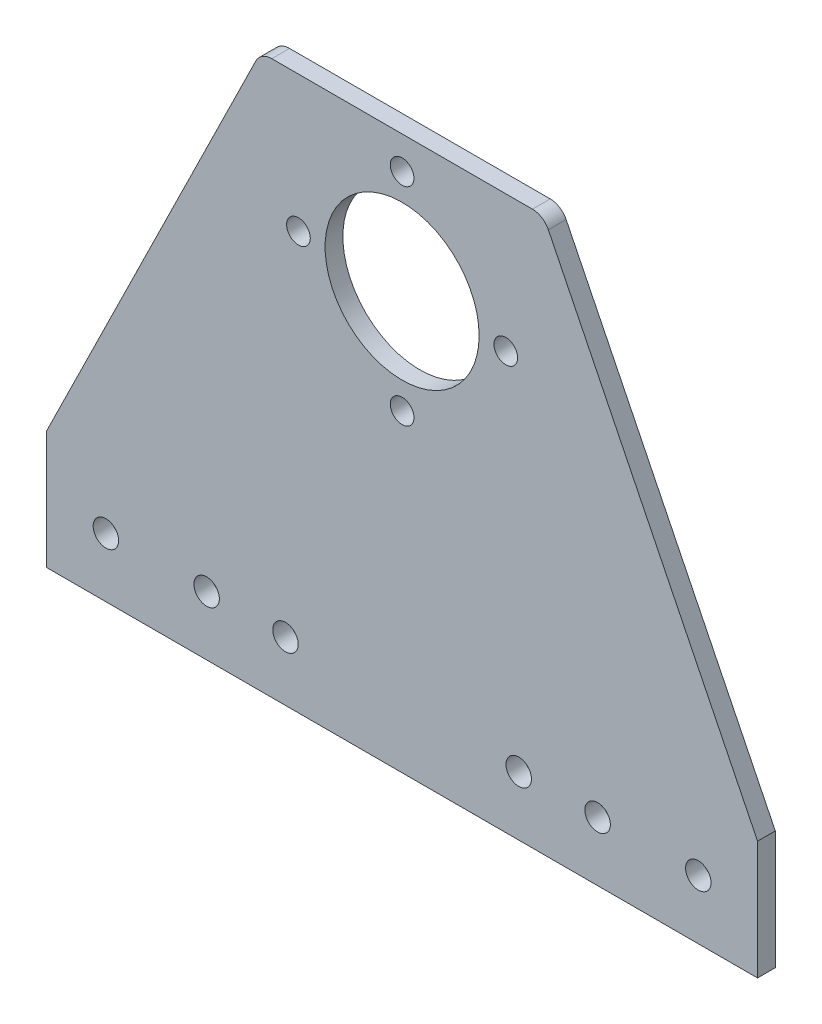
ISO-10303-21;
HEADER;
FILE_DESCRIPTION(('STEP AP214'),'2;1');
FILE_NAME('part.step','',(''),(''),'','','');
FILE_SCHEMA(('AUTOMOTIVE_DESIGN { 1 0 10303 214 1 1 1 1 }'));
ENDSEC;
DATA;
#1=APPLICATION_CONTEXT('core data for automotive mechanical design processes');
#2=APPLICATION_PROTOCOL_DEFINITION('international standard','automotive_design',2000,#1);
#3=PRODUCT_CONTEXT('',#1,'mechanical');
#4=PRODUCT('Part','Part','',(#3));
#5=PRODUCT_RELATED_PRODUCT_CATEGORY('part','',(#4));
#6=PRODUCT_DEFINITION_FORMATION('','',#4);
#7=PRODUCT_DEFINITION_CONTEXT('part definition',#1,'design');
#8=PRODUCT_DEFINITION('design','',#6,#7);
#9=PRODUCT_DEFINITION_SHAPE('','',#8);
#10=(LENGTH_UNIT() NAMED_UNIT(*) SI_UNIT(.MILLI.,.METRE.));
#11=(NAMED_UNIT(*) PLANE_ANGLE_UNIT() SI_UNIT($,.RADIAN.));
#12=(NAMED_UNIT(*) SI_UNIT($,.STERADIAN.) SOLID_ANGLE_UNIT());
#13=UNCERTAINTY_MEASURE_WITH_UNIT(LENGTH_MEASURE(1.E-05),#10,'distance_accuracy_value','');
#14=(GEOMETRIC_REPRESENTATION_CONTEXT(3) GLOBAL_UNCERTAINTY_ASSIGNED_CONTEXT((#13)) GLOBAL_UNIT_ASSIGNED_CONTEXT((#10,
#11,#12)) REPRESENTATION_CONTEXT('',''));
#15=CARTESIAN_POINT('',(0.,0.,0.));
#16=DIRECTION('',(0.,0.,1.));
#17=DIRECTION('',(1.,0.,0.));
#18=AXIS2_PLACEMENT_3D('',#15,#16,#17);
#19=CARTESIAN_POINT('',(49.1386740943103,49.,3.));
#20=DIRECTION('',(0.,0.,1.));
#21=DIRECTION('',(1.,0.,0.));
#22=AXIS2_PLACEMENT_3D('',#19,#20,#21);
#23=PLANE('',#22);
#24=CARTESIAN_POINT('',(53.6386740943105,29.0028734966438,3.));
#25=DIRECTION('',(0.,0.,1.));
#26=DIRECTION('',(1.,0.,0.));
#27=AXIS2_PLACEMENT_3D('',#24,#25,#26);
#28=CIRCLE('',#27,2.);
#29=CARTESIAN_POINT('',(55.6386740943105,29.0028734966438,3.));
#30=VERTEX_POINT('',#29);
#31=EDGE_CURVE('E232',#30,#30,#28,.T.);
#32=ORIENTED_EDGE('',*,*,#31,.F.);
#33=EDGE_LOOP('',(#32));
#34=FACE_BOUND('',#33,.T.);
#35=CARTESIAN_POINT('',(51.4500965538603,-31.3971265033562,3.));
#36=DIRECTION('',(0.,0.,1.));
#37=DIRECTION('',(1.,0.,0.));
#38=AXIS2_PLACEMENT_3D('',#35,#36,#37);
#39=CIRCLE('',#38,2.14999999999999);
#40=CARTESIAN_POINT('',(53.6000965538603,-31.3971265033562,3.));
#41=VERTEX_POINT('',#40);
#42=EDGE_CURVE('E220',#41,#41,#39,.T.);
#43=ORIENTED_EDGE('',*,*,#42,.F.);
#44=EDGE_LOOP('',(#43));
#45=FACE_BOUND('',#44,.T.);
#46=CARTESIAN_POINT('',(104.13867409431,-31.3971265033562,3.));
#47=DIRECTION('',(0.,0.,1.));
#48=DIRECTION('',(1.,0.,0.));
#49=AXIS2_PLACEMENT_3D('',#46,#47,#48);
#50=CIRCLE('',#49,2.15);
#51=CARTESIAN_POINT('',(106.28867409431,-31.3971265033562,3.));
#52=VERTEX_POINT('',#51);
#53=EDGE_CURVE('E208',#52,#52,#50,.T.);
#54=ORIENTED_EDGE('',*,*,#53,.F.);
#55=EDGE_LOOP('',(#54));
#56=FACE_BOUND('',#55,.T.);
#57=CARTESIAN_POINT('',(88.6386740943105,29.0028734966437,3.));
#58=DIRECTION('',(0.,0.,1.));
#59=DIRECTION('',(1.,0.,0.));
#60=AXIS2_PLACEMENT_3D('',#57,#58,#59);
#61=CIRCLE('',#60,2.);
#62=CARTESIAN_POINT('',(90.6386740943105,29.0028734966437,3.));
#63=VERTEX_POINT('',#62);
#64=EDGE_CURVE('E196',#63,#63,#61,.T.);
#65=ORIENTED_EDGE('',*,*,#64,.F.);
#66=EDGE_LOOP('',(#65));
#67=FACE_BOUND('',#66,.T.);
#68=CARTESIAN_POINT('',(121.13867409431,-31.3971265033564,3.));
#69=DIRECTION('',(0.,0.,1.));
#70=DIRECTION('',(1.,0.,0.));
#71=AXIS2_PLACEMENT_3D('',#68,#69,#70);
#72=CIRCLE('',#71,2.15);
#73=CARTESIAN_POINT('',(123.28867409431,-31.3971265033564,3.));
#74=VERTEX_POINT('',#73);
#75=EDGE_CURVE('E184',#74,#74,#72,.T.);
#76=ORIENTED_EDGE('',*,*,#75,.F.);
#77=EDGE_LOOP('',(#76));
#78=FACE_BOUND('',#77,.T.);
#79=CARTESIAN_POINT('',(49.1386740943103,49.,3.));
#80=DIRECTION('',(0.,0.,1.));
#81=DIRECTION('',(1.,0.,0.));
#82=AXIS2_PLACEMENT_3D('',#79,#80,#81);
#83=CIRCLE('',#82,3.00000000000002);
#84=CARTESIAN_POINT('',(49.1386740943103,52.,3.));
#85=VERTEX_POINT('',#84);
#86=CARTESIAN_POINT('',(46.4471487979062,50.3250251238438,3.));
#87=VERTEX_POINT('',#86);
#88=EDGE_CURVE('E147',#85,#87,#83,.T.);
#89=ORIENTED_EDGE('',*,*,#88,.T.);
#90=DIRECTION('',(-0.441675041281248,-0.897175098801348,0.));
#91=VECTOR('',#90,1.);
#92=CARTESIAN_POINT('',(46.4471487979062,50.3250251238438,3.));
#93=LINE('',#92,#91);
#94=CARTESIAN_POINT('',(11.1386740943103,-21.3971265033563,3.));
#95=VERTEX_POINT('',#94);
#96=EDGE_CURVE('E95',#87,#95,#93,.T.);
#97=ORIENTED_EDGE('',*,*,#96,.T.);
#98=DIRECTION('',(0.,-1.,0.));
#99=VECTOR('',#98,1.);
#100=CARTESIAN_POINT('',(11.1386740943103,-21.3971265033563,3.));
#101=LINE('',#100,#99);
#102=CARTESIAN_POINT('',(11.1386740943103,-41.3971265033564,3.));
#103=VERTEX_POINT('',#102);
#104=EDGE_CURVE('E162',#95,#103,#101,.T.);
#105=ORIENTED_EDGE('',*,*,#104,.T.);
#106=DIRECTION('',(1.,0.,0.));
#107=VECTOR('',#106,1.);
#108=CARTESIAN_POINT('',(11.1386740943103,-41.3971265033564,3.));
#109=LINE('',#108,#107);
#110=CARTESIAN_POINT('',(131.13867409431,-41.3971265033564,3.));
#111=VERTEX_POINT('',#110);
#112=EDGE_CURVE('E175',#103,#111,#109,.T.);
#113=ORIENTED_EDGE('',*,*,#112,.T.);
#114=DIRECTION('',(0.,1.,0.));
#115=VECTOR('',#114,1.);
#116=CARTESIAN_POINT('',(131.13867409431,-41.3971265033564,3.));
#117=LINE('',#116,#115);
#118=CARTESIAN_POINT('',(131.13867409431,-21.3971265033563,3.));
#119=VERTEX_POINT('',#118);
#120=EDGE_CURVE('E114',#111,#119,#117,.T.);
#121=ORIENTED_EDGE('',*,*,#120,.T.);
#122=DIRECTION('',(-0.441675041281248,0.897175098801348,0.));
#123=VECTOR('',#122,1.);
#124=CARTESIAN_POINT('',(131.13867409431,-21.3971265033563,3.));
#125=LINE('',#124,#123);
#126=CARTESIAN_POINT('',(95.8301993907144,50.3250251238438,3.));
#127=VERTEX_POINT('',#126);
#128=EDGE_CURVE('E108',#119,#127,#125,.T.);
#129=ORIENTED_EDGE('',*,*,#128,.T.);
#130=CARTESIAN_POINT('',(93.1386740943103,49.,3.));
#131=DIRECTION('',(0.,0.,1.));
#132=DIRECTION('',(1.,0.,0.));
#133=AXIS2_PLACEMENT_3D('',#130,#131,#132);
#134=CIRCLE('',#133,3.00000000000004);
#135=CARTESIAN_POINT('',(93.1386740943103,52.,3.));
#136=VERTEX_POINT('',#135);
#137=EDGE_CURVE('E112',#127,#136,#134,.T.);
#138=ORIENTED_EDGE('',*,*,#137,.T.);
#139=DIRECTION('',(-1.,0.,0.));
#140=VECTOR('',#139,1.);
#141=CARTESIAN_POINT('',(93.1386740943103,52.,3.));
#142=LINE('',#141,#140);
#143=EDGE_CURVE('E52',#136,#85,#142,.T.);
#144=ORIENTED_EDGE('',*,*,#143,.T.);
#145=EDGE_LOOP('',(#89,#97,#105,#113,#121,#129,#138,#144));
#146=FACE_BOUND('',#145,.T.);
#147=CARTESIAN_POINT('',(21.1386740943103,-31.3971265033564,3.));
#148=DIRECTION('',(0.,0.,1.));
#149=DIRECTION('',(1.,0.,0.));
#150=AXIS2_PLACEMENT_3D('',#147,#148,#149);
#151=CIRCLE('',#150,2.15);
#152=CARTESIAN_POINT('',(23.2886740943103,-31.3971265033564,3.));
#153=VERTEX_POINT('',#152);
#154=EDGE_CURVE('E136',#153,#153,#151,.T.);
#155=ORIENTED_EDGE('',*,*,#154,.F.);
#156=EDGE_LOOP('',(#155));
#157=FACE_BOUND('',#156,.T.);
#158=CARTESIAN_POINT('',(71.1386740943105,29.0028734966437,3.));
#159=DIRECTION('',(0.,0.,1.));
#160=DIRECTION('',(1.,0.,0.));
#161=AXIS2_PLACEMENT_3D('',#158,#159,#160);
#162=CIRCLE('',#161,13.);
#163=CARTESIAN_POINT('',(84.1386740943105,29.0028734966437,3.));
#164=VERTEX_POINT('',#163);
#165=EDGE_CURVE('E190',#164,#164,#162,.T.);
#166=ORIENTED_EDGE('',*,*,#165,.F.);
#167=EDGE_LOOP('',(#166));
#168=FACE_BOUND('',#167,.T.);
#169=CARTESIAN_POINT('',(71.1386740943107,46.5028734966437,3.));
#170=DIRECTION('',(0.,0.,1.));
#171=DIRECTION('',(1.,0.,0.));
#172=AXIS2_PLACEMENT_3D('',#169,#170,#171);
#173=CIRCLE('',#172,2.);
#174=CARTESIAN_POINT('',(73.1386740943107,46.5028734966437,3.));
#175=VERTEX_POINT('',#174);
#176=EDGE_CURVE('E202',#175,#175,#173,.T.);
#177=ORIENTED_EDGE('',*,*,#176,.F.);
#178=EDGE_LOOP('',(#177));
#179=FACE_BOUND('',#178,.T.);
#180=CARTESIAN_POINT('',(90.8272516347602,-31.3971265033562,3.));
#181=DIRECTION('',(0.,0.,1.));
#182=DIRECTION('',(1.,0.,0.));
#183=AXIS2_PLACEMENT_3D('',#180,#181,#182);
#184=CIRCLE('',#183,2.15);
#185=CARTESIAN_POINT('',(92.9772516347602,-31.3971265033562,3.));
#186=VERTEX_POINT('',#185);
#187=EDGE_CURVE('E214',#186,#186,#184,.T.);
#188=ORIENTED_EDGE('',*,*,#187,.F.);
#189=EDGE_LOOP('',(#188));
#190=FACE_BOUND('',#189,.T.);
#191=CARTESIAN_POINT('',(38.1386740943102,-31.3971265033562,3.));
#192=DIRECTION('',(0.,0.,1.));
#193=DIRECTION('',(1.,0.,0.));
#194=AXIS2_PLACEMENT_3D('',#191,#192,#193);
#195=CIRCLE('',#194,2.15);
#196=CARTESIAN_POINT('',(40.2886740943102,-31.3971265033562,3.));
#197=VERTEX_POINT('',#196);
#198=EDGE_CURVE('E226',#197,#197,#195,.T.);
#199=ORIENTED_EDGE('',*,*,#198,.F.);
#200=EDGE_LOOP('',(#199));
#201=FACE_BOUND('',#200,.T.);
#202=CARTESIAN_POINT('',(71.1386740943105,11.5028734966437,3.));
#203=DIRECTION('',(0.,0.,1.));
#204=DIRECTION('',(1.,0.,0.));
#205=AXIS2_PLACEMENT_3D('',#202,#203,#204);
#206=CIRCLE('',#205,2.);
#207=CARTESIAN_POINT('',(73.1386740943105,11.5028734966437,3.));
#208=VERTEX_POINT('',#207);
#209=EDGE_CURVE('E238',#208,#208,#206,.T.);
#210=ORIENTED_EDGE('',*,*,#209,.F.);
#211=EDGE_LOOP('',(#210));
#212=FACE_BOUND('',#211,.T.);
#213=ADVANCED_FACE('F35',(#34,#45,#56,#67,#78,#146,#157,#168,#179,#190,#201,#212),#23,.T.);
#214=CARTESIAN_POINT('',(49.1386740943103,49.,0.));
#215=DIRECTION('',(0.,0.,1.));
#216=DIRECTION('',(1.,0.,0.));
#217=AXIS2_PLACEMENT_3D('',#214,#215,#216);
#218=PLANE('',#217);
#219=CARTESIAN_POINT('',(49.1386740943103,49.,0.));
#220=DIRECTION('',(0.,0.,1.));
#221=DIRECTION('',(1.,0.,0.));
#222=AXIS2_PLACEMENT_3D('',#219,#220,#221);
#223=CIRCLE('',#222,3.00000000000002);
#224=CARTESIAN_POINT('',(49.1386740943103,52.,0.));
#225=VERTEX_POINT('',#224);
#226=CARTESIAN_POINT('',(46.4471487979062,50.3250251238438,0.));
#227=VERTEX_POINT('',#226);
#228=EDGE_CURVE('E132',#225,#227,#223,.T.);
#229=ORIENTED_EDGE('',*,*,#228,.F.);
#230=DIRECTION('',(-1.,0.,0.));
#231=VECTOR('',#230,1.);
#232=CARTESIAN_POINT('',(93.1386740943103,52.,0.));
#233=LINE('',#232,#231);
#234=CARTESIAN_POINT('',(93.1386740943103,52.,0.));
#235=VERTEX_POINT('',#234);
#236=EDGE_CURVE('E87',#235,#225,#233,.T.);
#237=ORIENTED_EDGE('',*,*,#236,.F.);
#238=CARTESIAN_POINT('',(93.1386740943103,49.,0.));
#239=DIRECTION('',(0.,0.,1.));
#240=DIRECTION('',(1.,0.,0.));
#241=AXIS2_PLACEMENT_3D('',#238,#239,#240);
#242=CIRCLE('',#241,3.00000000000004);
#243=CARTESIAN_POINT('',(95.8301993907144,50.3250251238438,0.));
#244=VERTEX_POINT('',#243);
#245=EDGE_CURVE('E81',#244,#235,#242,.T.);
#246=ORIENTED_EDGE('',*,*,#245,.F.);
#247=DIRECTION('',(-0.441675041281248,0.897175098801348,0.));
#248=VECTOR('',#247,1.);
#249=CARTESIAN_POINT('',(131.13867409431,-21.3971265033563,0.));
#250=LINE('',#249,#248);
#251=CARTESIAN_POINT('',(131.13867409431,-21.3971265033563,0.));
#252=VERTEX_POINT('',#251);
#253=EDGE_CURVE('E122',#252,#244,#250,.T.);
#254=ORIENTED_EDGE('',*,*,#253,.F.);
#255=DIRECTION('',(0.,1.,0.));
#256=VECTOR('',#255,1.);
#257=CARTESIAN_POINT('',(131.13867409431,-41.3971265033564,0.));
#258=LINE('',#257,#256);
#259=CARTESIAN_POINT('',(131.13867409431,-41.3971265033564,0.));
#260=VERTEX_POINT('',#259);
#261=EDGE_CURVE('E142',#260,#252,#258,.T.);
#262=ORIENTED_EDGE('',*,*,#261,.F.);
#263=DIRECTION('',(1.,0.,0.));
#264=VECTOR('',#263,1.);
#265=CARTESIAN_POINT('',(11.1386740943103,-41.3971265033564,0.));
#266=LINE('',#265,#264);
#267=CARTESIAN_POINT('',(11.1386740943103,-41.3971265033564,0.));
#268=VERTEX_POINT('',#267);
#269=EDGE_CURVE('E140',#268,#260,#266,.T.);
#270=ORIENTED_EDGE('',*,*,#269,.F.);
#271=DIRECTION('',(0.,-1.,0.));
#272=VECTOR('',#271,1.);
#273=CARTESIAN_POINT('',(11.1386740943103,-21.3971265033563,0.));
#274=LINE('',#273,#272);
#275=CARTESIAN_POINT('',(11.1386740943103,-21.3971265033563,0.));
#276=VERTEX_POINT('',#275);
#277=EDGE_CURVE('E138',#276,#268,#274,.T.);
#278=ORIENTED_EDGE('',*,*,#277,.F.);
#279=DIRECTION('',(-0.441675041281248,-0.897175098801348,0.));
#280=VECTOR('',#279,1.);
#281=CARTESIAN_POINT('',(46.4471487979062,50.3250251238438,0.));
#282=LINE('',#281,#280);
#283=EDGE_CURVE('E135',#227,#276,#282,.T.);
#284=ORIENTED_EDGE('',*,*,#283,.F.);
#285=EDGE_LOOP('',(#229,#237,#246,#254,#262,#270,#278,#284));
#286=FACE_BOUND('',#285,.T.);
#287=CARTESIAN_POINT('',(21.1386740943103,-31.3971265033564,0.));
#288=DIRECTION('',(0.,0.,1.));
#289=DIRECTION('',(1.,0.,0.));
#290=AXIS2_PLACEMENT_3D('',#287,#288,#289);
#291=CIRCLE('',#290,2.15);
#292=CARTESIAN_POINT('',(23.2886740943103,-31.3971265033564,0.));
#293=VERTEX_POINT('',#292);
#294=EDGE_CURVE('E181',#293,#293,#291,.T.);
#295=ORIENTED_EDGE('',*,*,#294,.T.);
#296=EDGE_LOOP('',(#295));
#297=FACE_BOUND('',#296,.T.);
#298=CARTESIAN_POINT('',(121.13867409431,-31.3971265033564,0.));
#299=DIRECTION('',(0.,0.,1.));
#300=DIRECTION('',(1.,0.,0.));
#301=AXIS2_PLACEMENT_3D('',#298,#299,#300);
#302=CIRCLE('',#301,2.15);
#303=CARTESIAN_POINT('',(123.28867409431,-31.3971265033564,0.));
#304=VERTEX_POINT('',#303);
#305=EDGE_CURVE('E187',#304,#304,#302,.T.);
#306=ORIENTED_EDGE('',*,*,#305,.T.);
#307=EDGE_LOOP('',(#306));
#308=FACE_BOUND('',#307,.T.);
#309=CARTESIAN_POINT('',(71.1386740943105,29.0028734966437,0.));
#310=DIRECTION('',(0.,0.,1.));
#311=DIRECTION('',(1.,0.,0.));
#312=AXIS2_PLACEMENT_3D('',#309,#310,#311);
#313=CIRCLE('',#312,13.);
#314=CARTESIAN_POINT('',(84.1386740943105,29.0028734966437,0.));
#315=VERTEX_POINT('',#314);
#316=EDGE_CURVE('E193',#315,#315,#313,.T.);
#317=ORIENTED_EDGE('',*,*,#316,.T.);
#318=EDGE_LOOP('',(#317));
#319=FACE_BOUND('',#318,.T.);
#320=CARTESIAN_POINT('',(88.6386740943105,29.0028734966437,0.));
#321=DIRECTION('',(0.,0.,1.));
#322=DIRECTION('',(1.,0.,0.));
#323=AXIS2_PLACEMENT_3D('',#320,#321,#322);
#324=CIRCLE('',#323,2.);
#325=CARTESIAN_POINT('',(90.6386740943105,29.0028734966437,0.));
#326=VERTEX_POINT('',#325);
#327=EDGE_CURVE('E199',#326,#326,#324,.T.);
#328=ORIENTED_EDGE('',*,*,#327,.T.);
#329=EDGE_LOOP('',(#328));
#330=FACE_BOUND('',#329,.T.);
#331=CARTESIAN_POINT('',(71.1386740943107,46.5028734966437,0.));
#332=DIRECTION('',(0.,0.,1.));
#333=DIRECTION('',(1.,0.,0.));
#334=AXIS2_PLACEMENT_3D('',#331,#332,#333);
#335=CIRCLE('',#334,2.);
#336=CARTESIAN_POINT('',(73.1386740943107,46.5028734966437,0.));
#337=VERTEX_POINT('',#336);
#338=EDGE_CURVE('E205',#337,#337,#335,.T.);
#339=ORIENTED_EDGE('',*,*,#338,.T.);
#340=EDGE_LOOP('',(#339));
#341=FACE_BOUND('',#340,.T.);
#342=CARTESIAN_POINT('',(104.13867409431,-31.3971265033562,0.));
#343=DIRECTION('',(0.,0.,1.));
#344=DIRECTION('',(1.,0.,0.));
#345=AXIS2_PLACEMENT_3D('',#342,#343,#344);
#346=CIRCLE('',#345,2.15);
#347=CARTESIAN_POINT('',(106.28867409431,-31.3971265033562,0.));
#348=VERTEX_POINT('',#347);
#349=EDGE_CURVE('E211',#348,#348,#346,.T.);
#350=ORIENTED_EDGE('',*,*,#349,.T.);
#351=EDGE_LOOP('',(#350));
#352=FACE_BOUND('',#351,.T.);
#353=CARTESIAN_POINT('',(90.8272516347602,-31.3971265033562,0.));
#354=DIRECTION('',(0.,0.,1.));
#355=DIRECTION('',(1.,0.,0.));
#356=AXIS2_PLACEMENT_3D('',#353,#354,#355);
#357=CIRCLE('',#356,2.15);
#358=CARTESIAN_POINT('',(92.9772516347602,-31.3971265033562,0.));
#359=VERTEX_POINT('',#358);
#360=EDGE_CURVE('E217',#359,#359,#357,.T.);
#361=ORIENTED_EDGE('',*,*,#360,.T.);
#362=EDGE_LOOP('',(#361));
#363=FACE_BOUND('',#362,.T.);
#364=CARTESIAN_POINT('',(51.4500965538603,-31.3971265033562,0.));
#365=DIRECTION('',(0.,0.,1.));
#366=DIRECTION('',(1.,0.,0.));
#367=AXIS2_PLACEMENT_3D('',#364,#365,#366);
#368=CIRCLE('',#367,2.14999999999999);
#369=CARTESIAN_POINT('',(53.6000965538603,-31.3971265033562,0.));
#370=VERTEX_POINT('',#369);
#371=EDGE_CURVE('E223',#370,#370,#368,.T.);
#372=ORIENTED_EDGE('',*,*,#371,.T.);
#373=EDGE_LOOP('',(#372));
#374=FACE_BOUND('',#373,.T.);
#375=CARTESIAN_POINT('',(38.1386740943102,-31.3971265033562,0.));
#376=DIRECTION('',(0.,0.,1.));
#377=DIRECTION('',(1.,0.,0.));
#378=AXIS2_PLACEMENT_3D('',#375,#376,#377);
#379=CIRCLE('',#378,2.15);
#380=CARTESIAN_POINT('',(40.2886740943102,-31.3971265033562,0.));
#381=VERTEX_POINT('',#380);
#382=EDGE_CURVE('E229',#381,#381,#379,.T.);
#383=ORIENTED_EDGE('',*,*,#382,.T.);
#384=EDGE_LOOP('',(#383));
#385=FACE_BOUND('',#384,.T.);
#386=CARTESIAN_POINT('',(53.6386740943105,29.0028734966438,0.));
#387=DIRECTION('',(0.,0.,1.));
#388=DIRECTION('',(1.,0.,0.));
#389=AXIS2_PLACEMENT_3D('',#386,#387,#388);
#390=CIRCLE('',#389,2.);
#391=CARTESIAN_POINT('',(55.6386740943105,29.0028734966438,0.));
#392=VERTEX_POINT('',#391);
#393=EDGE_CURVE('E235',#392,#392,#390,.T.);
#394=ORIENTED_EDGE('',*,*,#393,.T.);
#395=EDGE_LOOP('',(#394));
#396=FACE_BOUND('',#395,.T.);
#397=CARTESIAN_POINT('',(71.1386740943105,11.5028734966437,0.));
#398=DIRECTION('',(0.,0.,1.));
#399=DIRECTION('',(1.,0.,0.));
#400=AXIS2_PLACEMENT_3D('',#397,#398,#399);
#401=CIRCLE('',#400,2.);
#402=CARTESIAN_POINT('',(73.1386740943105,11.5028734966437,0.));
#403=VERTEX_POINT('',#402);
#404=EDGE_CURVE('E241',#403,#403,#401,.T.);
#405=ORIENTED_EDGE('',*,*,#404,.T.);
#406=EDGE_LOOP('',(#405));
#407=FACE_BOUND('',#406,.T.);
#408=ADVANCED_FACE('F166',(#286,#297,#308,#319,#330,#341,#352,#363,#374,#385,#396,#407),#218,.F.);
#409=CARTESIAN_POINT('',(49.1386740943103,49.,3.));
#410=DIRECTION('',(0.,0.,-1.));
#411=DIRECTION('',(-1.,0.,0.));
#412=AXIS2_PLACEMENT_3D('',#409,#410,#411);
#413=CYLINDRICAL_SURFACE('',#412,3.00000000000002);
#414=ORIENTED_EDGE('',*,*,#228,.T.);
#415=DIRECTION('',(0.,0.,-1.));
#416=VECTOR('',#415,1.);
#417=CARTESIAN_POINT('',(46.4471487979062,50.3250251238438,3.));
#418=LINE('',#417,#416);
#419=EDGE_CURVE('E11',#87,#227,#418,.T.);
#420=ORIENTED_EDGE('',*,*,#419,.F.);
#421=ORIENTED_EDGE('',*,*,#88,.F.);
#422=DIRECTION('',(0.,0.,-1.));
#423=VECTOR('',#422,1.);
#424=CARTESIAN_POINT('',(49.1386740943103,52.,3.));
#425=LINE('',#424,#423);
#426=EDGE_CURVE('E128',#85,#225,#425,.T.);
#427=ORIENTED_EDGE('',*,*,#426,.T.);
#428=EDGE_LOOP('',(#414,#420,#421,#427));
#429=FACE_BOUND('',#428,.T.);
#430=ADVANCED_FACE('F37',(#429),#413,.T.);
#431=CARTESIAN_POINT('',(46.4471487979062,50.3250251238438,3.));
#432=DIRECTION('',(0.897175098801347,-0.441675041281248,0.));
#433=DIRECTION('',(0.441675041281248,0.897175098801347,0.));
#434=AXIS2_PLACEMENT_3D('',#431,#432,#433);
#435=PLANE('',#434);
#436=ORIENTED_EDGE('',*,*,#283,.T.);
#437=DIRECTION('',(0.,0.,-1.));
#438=VECTOR('',#437,1.);
#439=CARTESIAN_POINT('',(11.1386740943103,-21.3971265033563,3.));
#440=LINE('',#439,#438);
#441=EDGE_CURVE('E44',#95,#276,#440,.T.);
#442=ORIENTED_EDGE('',*,*,#441,.F.);
#443=ORIENTED_EDGE('',*,*,#96,.F.);
#444=ORIENTED_EDGE('',*,*,#419,.T.);
#445=EDGE_LOOP('',(#436,#442,#443,#444));
#446=FACE_BOUND('',#445,.T.);
#447=ADVANCED_FACE('F274',(#446),#435,.F.);
#448=CARTESIAN_POINT('',(11.1386740943103,-21.3971265033563,3.));
#449=DIRECTION('',(1.,0.,0.));
#450=DIRECTION('',(0.,1.,0.));
#451=AXIS2_PLACEMENT_3D('',#448,#449,#450);
#452=PLANE('',#451);
#453=ORIENTED_EDGE('',*,*,#277,.T.);
#454=DIRECTION('',(0.,0.,-1.));
#455=VECTOR('',#454,1.);
#456=CARTESIAN_POINT('',(11.1386740943103,-41.3971265033564,3.));
#457=LINE('',#456,#455);
#458=EDGE_CURVE('E154',#103,#268,#457,.T.);
#459=ORIENTED_EDGE('',*,*,#458,.F.);
#460=ORIENTED_EDGE('',*,*,#104,.F.);
#461=ORIENTED_EDGE('',*,*,#441,.T.);
#462=EDGE_LOOP('',(#453,#459,#460,#461));
#463=FACE_BOUND('',#462,.T.);
#464=ADVANCED_FACE('F160',(#463),#452,.F.);
#465=CARTESIAN_POINT('',(11.1386740943103,-41.3971265033564,3.));
#466=DIRECTION('',(0.,1.,0.));
#467=DIRECTION('',(0.,0.,1.));
#468=AXIS2_PLACEMENT_3D('',#465,#466,#467);
#469=PLANE('',#468);
#470=ORIENTED_EDGE('',*,*,#269,.T.);
#471=DIRECTION('',(0.,0.,-1.));
#472=VECTOR('',#471,1.);
#473=CARTESIAN_POINT('',(131.13867409431,-41.3971265033564,3.));
#474=LINE('',#473,#472);
#475=EDGE_CURVE('E151',#111,#260,#474,.T.);
#476=ORIENTED_EDGE('',*,*,#475,.F.);
#477=ORIENTED_EDGE('',*,*,#112,.F.);
#478=ORIENTED_EDGE('',*,*,#458,.T.);
#479=EDGE_LOOP('',(#470,#476,#477,#478));
#480=FACE_BOUND('',#479,.T.);
#481=ADVANCED_FACE('F171',(#480),#469,.F.);
#482=CARTESIAN_POINT('',(131.13867409431,-41.3971265033564,3.));
#483=DIRECTION('',(-1.,0.,0.));
#484=DIRECTION('',(0.,0.,1.));
#485=AXIS2_PLACEMENT_3D('',#482,#483,#484);
#486=PLANE('',#485);
#487=ORIENTED_EDGE('',*,*,#261,.T.);
#488=DIRECTION('',(0.,0.,-1.));
#489=VECTOR('',#488,1.);
#490=CARTESIAN_POINT('',(131.13867409431,-21.3971265033563,3.));
#491=LINE('',#490,#489);
#492=EDGE_CURVE('E123',#119,#252,#491,.T.);
#493=ORIENTED_EDGE('',*,*,#492,.F.);
#494=ORIENTED_EDGE('',*,*,#120,.F.);
#495=ORIENTED_EDGE('',*,*,#475,.T.);
#496=EDGE_LOOP('',(#487,#493,#494,#495));
#497=FACE_BOUND('',#496,.T.);
#498=ADVANCED_FACE('F174',(#497),#486,.F.);
#499=CARTESIAN_POINT('',(131.13867409431,-21.3971265033563,3.));
#500=DIRECTION('',(-0.897175098801348,-0.441675041281248,0.));
#501=DIRECTION('',(0.441675041281248,-0.897175098801348,0.));
#502=AXIS2_PLACEMENT_3D('',#499,#500,#501);
#503=PLANE('',#502);
#504=ORIENTED_EDGE('',*,*,#253,.T.);
#505=DIRECTION('',(0.,0.,-1.));
#506=VECTOR('',#505,1.);
#507=CARTESIAN_POINT('',(95.8301993907144,50.3250251238438,3.));
#508=LINE('',#507,#506);
#509=EDGE_CURVE('E119',#127,#244,#508,.T.);
#510=ORIENTED_EDGE('',*,*,#509,.F.);
#511=ORIENTED_EDGE('',*,*,#128,.F.);
#512=ORIENTED_EDGE('',*,*,#492,.T.);
#513=EDGE_LOOP('',(#504,#510,#511,#512));
#514=FACE_BOUND('',#513,.T.);
#515=ADVANCED_FACE('F120',(#514),#503,.F.);
#516=CARTESIAN_POINT('',(93.1386740943103,49.,3.));
#517=DIRECTION('',(0.,0.,-1.));
#518=DIRECTION('',(-1.,0.,0.));
#519=AXIS2_PLACEMENT_3D('',#516,#517,#518);
#520=CYLINDRICAL_SURFACE('',#519,3.00000000000004);
#521=ORIENTED_EDGE('',*,*,#245,.T.);
#522=DIRECTION('',(0.,0.,-1.));
#523=VECTOR('',#522,1.);
#524=CARTESIAN_POINT('',(93.1386740943103,52.,3.));
#525=LINE('',#524,#523);
#526=EDGE_CURVE('E124',#136,#235,#525,.T.);
#527=ORIENTED_EDGE('',*,*,#526,.F.);
#528=ORIENTED_EDGE('',*,*,#137,.F.);
#529=ORIENTED_EDGE('',*,*,#509,.T.);
#530=EDGE_LOOP('',(#521,#527,#528,#529));
#531=FACE_BOUND('',#530,.T.);
#532=ADVANCED_FACE('F126',(#531),#520,.T.);
#533=CARTESIAN_POINT('',(93.1386740943103,52.,3.));
#534=DIRECTION('',(0.,-1.,0.));
#535=DIRECTION('',(1.,0.,0.));
#536=AXIS2_PLACEMENT_3D('',#533,#534,#535);
#537=PLANE('',#536);
#538=ORIENTED_EDGE('',*,*,#236,.T.);
#539=ORIENTED_EDGE('',*,*,#426,.F.);
#540=ORIENTED_EDGE('',*,*,#143,.F.);
#541=ORIENTED_EDGE('',*,*,#526,.T.);
#542=EDGE_LOOP('',(#538,#539,#540,#541));
#543=FACE_BOUND('',#542,.T.);
#544=ADVANCED_FACE('F262',(#543),#537,.F.);
#545=CARTESIAN_POINT('',(21.1386740943103,-31.3971265033564,3.));
#546=DIRECTION('',(0.,0.,-1.));
#547=DIRECTION('',(-1.,0.,0.));
#548=AXIS2_PLACEMENT_3D('',#545,#546,#547);
#549=CYLINDRICAL_SURFACE('',#548,2.15);
#550=ORIENTED_EDGE('',*,*,#154,.T.);
#551=EDGE_LOOP('',(#550));
#552=FACE_BOUND('',#551,.T.);
#553=ORIENTED_EDGE('',*,*,#294,.F.);
#554=EDGE_LOOP('',(#553));
#555=FACE_BOUND('',#554,.T.);
#556=ADVANCED_FACE('F259',(#552,#555),#549,.F.);
#557=CARTESIAN_POINT('',(121.13867409431,-31.3971265033564,3.));
#558=DIRECTION('',(0.,0.,-1.));
#559=DIRECTION('',(-1.,0.,0.));
#560=AXIS2_PLACEMENT_3D('',#557,#558,#559);
#561=CYLINDRICAL_SURFACE('',#560,2.15);
#562=ORIENTED_EDGE('',*,*,#75,.T.);
#563=EDGE_LOOP('',(#562));
#564=FACE_BOUND('',#563,.T.);
#565=ORIENTED_EDGE('',*,*,#305,.F.);
#566=EDGE_LOOP('',(#565));
#567=FACE_BOUND('',#566,.T.);
#568=ADVANCED_FACE('F338',(#564,#567),#561,.F.);
#569=CARTESIAN_POINT('',(71.1386740943105,29.0028734966437,3.));
#570=DIRECTION('',(0.,0.,-1.));
#571=DIRECTION('',(-1.,0.,0.));
#572=AXIS2_PLACEMENT_3D('',#569,#570,#571);
#573=CYLINDRICAL_SURFACE('',#572,13.);
#574=ORIENTED_EDGE('',*,*,#316,.F.);
#575=EDGE_LOOP('',(#574));
#576=FACE_BOUND('',#575,.T.);
#577=ORIENTED_EDGE('',*,*,#165,.T.);
#578=EDGE_LOOP('',(#577));
#579=FACE_BOUND('',#578,.T.);
#580=ADVANCED_FACE('F346',(#576,#579),#573,.F.);
#581=CARTESIAN_POINT('',(88.6386740943105,29.0028734966437,3.));
#582=DIRECTION('',(0.,0.,-1.));
#583=DIRECTION('',(-1.,0.,0.));
#584=AXIS2_PLACEMENT_3D('',#581,#582,#583);
#585=CYLINDRICAL_SURFACE('',#584,2.);
#586=ORIENTED_EDGE('',*,*,#327,.F.);
#587=EDGE_LOOP('',(#586));
#588=FACE_BOUND('',#587,.T.);
#589=ORIENTED_EDGE('',*,*,#64,.T.);
#590=EDGE_LOOP('',(#589));
#591=FACE_BOUND('',#590,.T.);
#592=ADVANCED_FACE('F354',(#588,#591),#585,.F.);
#593=CARTESIAN_POINT('',(71.1386740943107,46.5028734966437,3.));
#594=DIRECTION('',(0.,0.,-1.));
#595=DIRECTION('',(-1.,0.,0.));
#596=AXIS2_PLACEMENT_3D('',#593,#594,#595);
#597=CYLINDRICAL_SURFACE('',#596,2.);
#598=ORIENTED_EDGE('',*,*,#338,.F.);
#599=EDGE_LOOP('',(#598));
#600=FACE_BOUND('',#599,.T.);
#601=ORIENTED_EDGE('',*,*,#176,.T.);
#602=EDGE_LOOP('',(#601));
#603=FACE_BOUND('',#602,.T.);
#604=ADVANCED_FACE('F366',(#600,#603),#597,.F.);
#605=CARTESIAN_POINT('',(104.13867409431,-31.3971265033562,3.));
#606=DIRECTION('',(0.,0.,-1.));
#607=DIRECTION('',(-1.,0.,0.));
#608=AXIS2_PLACEMENT_3D('',#605,#606,#607);
#609=CYLINDRICAL_SURFACE('',#608,2.15);
#610=ORIENTED_EDGE('',*,*,#53,.T.);
#611=EDGE_LOOP('',(#610));
#612=FACE_BOUND('',#611,.T.);
#613=ORIENTED_EDGE('',*,*,#349,.F.);
#614=EDGE_LOOP('',(#613));
#615=FACE_BOUND('',#614,.T.);
#616=ADVANCED_FACE('F378',(#612,#615),#609,.F.);
#617=CARTESIAN_POINT('',(90.8272516347602,-31.3971265033562,3.));
#618=DIRECTION('',(0.,0.,-1.));
#619=DIRECTION('',(-1.,0.,0.));
#620=AXIS2_PLACEMENT_3D('',#617,#618,#619);
#621=CYLINDRICAL_SURFACE('',#620,2.15);
#622=ORIENTED_EDGE('',*,*,#187,.T.);
#623=EDGE_LOOP('',(#622));
#624=FACE_BOUND('',#623,.T.);
#625=ORIENTED_EDGE('',*,*,#360,.F.);
#626=EDGE_LOOP('',(#625));
#627=FACE_BOUND('',#626,.T.);
#628=ADVANCED_FACE('F390',(#624,#627),#621,.F.);
#629=CARTESIAN_POINT('',(51.4500965538603,-31.3971265033562,3.));
#630=DIRECTION('',(0.,0.,-1.));
#631=DIRECTION('',(-1.,0.,0.));
#632=AXIS2_PLACEMENT_3D('',#629,#630,#631);
#633=CYLINDRICAL_SURFACE('',#632,2.14999999999999);
#634=ORIENTED_EDGE('',*,*,#42,.T.);
#635=EDGE_LOOP('',(#634));
#636=FACE_BOUND('',#635,.T.);
#637=ORIENTED_EDGE('',*,*,#371,.F.);
#638=EDGE_LOOP('',(#637));
#639=FACE_BOUND('',#638,.T.);
#640=ADVANCED_FACE('F399',(#636,#639),#633,.F.);
#641=CARTESIAN_POINT('',(38.1386740943102,-31.3971265033562,3.));
#642=DIRECTION('',(0.,0.,-1.));
#643=DIRECTION('',(-1.,0.,0.));
#644=AXIS2_PLACEMENT_3D('',#641,#642,#643);
#645=CYLINDRICAL_SURFACE('',#644,2.15);
#646=ORIENTED_EDGE('',*,*,#198,.T.);
#647=EDGE_LOOP('',(#646));
#648=FACE_BOUND('',#647,.T.);
#649=ORIENTED_EDGE('',*,*,#382,.F.);
#650=EDGE_LOOP('',(#649));
#651=FACE_BOUND('',#650,.T.);
#652=ADVANCED_FACE('F408',(#648,#651),#645,.F.);
#653=CARTESIAN_POINT('',(53.6386740943105,29.0028734966438,3.));
#654=DIRECTION('',(0.,0.,-1.));
#655=DIRECTION('',(-1.,0.,0.));
#656=AXIS2_PLACEMENT_3D('',#653,#654,#655);
#657=CYLINDRICAL_SURFACE('',#656,2.);
#658=ORIENTED_EDGE('',*,*,#393,.F.);
#659=EDGE_LOOP('',(#658));
#660=FACE_BOUND('',#659,.T.);
#661=ORIENTED_EDGE('',*,*,#31,.T.);
#662=EDGE_LOOP('',(#661));
#663=FACE_BOUND('',#662,.T.);
#664=ADVANCED_FACE('F417',(#660,#663),#657,.F.);
#665=CARTESIAN_POINT('',(71.1386740943105,11.5028734966437,3.));
#666=DIRECTION('',(0.,0.,-1.));
#667=DIRECTION('',(-1.,0.,0.));
#668=AXIS2_PLACEMENT_3D('',#665,#666,#667);
#669=CYLINDRICAL_SURFACE('',#668,2.);
#670=ORIENTED_EDGE('',*,*,#404,.F.);
#671=EDGE_LOOP('',(#670));
#672=FACE_BOUND('',#671,.T.);
#673=ORIENTED_EDGE('',*,*,#209,.T.);
#674=EDGE_LOOP('',(#673));
#675=FACE_BOUND('',#674,.T.);
#676=ADVANCED_FACE('F247',(#672,#675),#669,.F.);
#677=CLOSED_SHELL('',(#213,#408,#430,#447,#464,#481,#498,#515,#532,#544,#556,#568,#580,#592,
#604,#616,#628,#640,#652,#664,#676));
#678=MANIFOLD_SOLID_BREP('B2',#677);
#679=ADVANCED_BREP_SHAPE_REPRESENTATION('',(#18,#678),#14);
#680=SHAPE_DEFINITION_REPRESENTATION(#9,#679);
ENDSEC;
END-ISO-10303-21;
